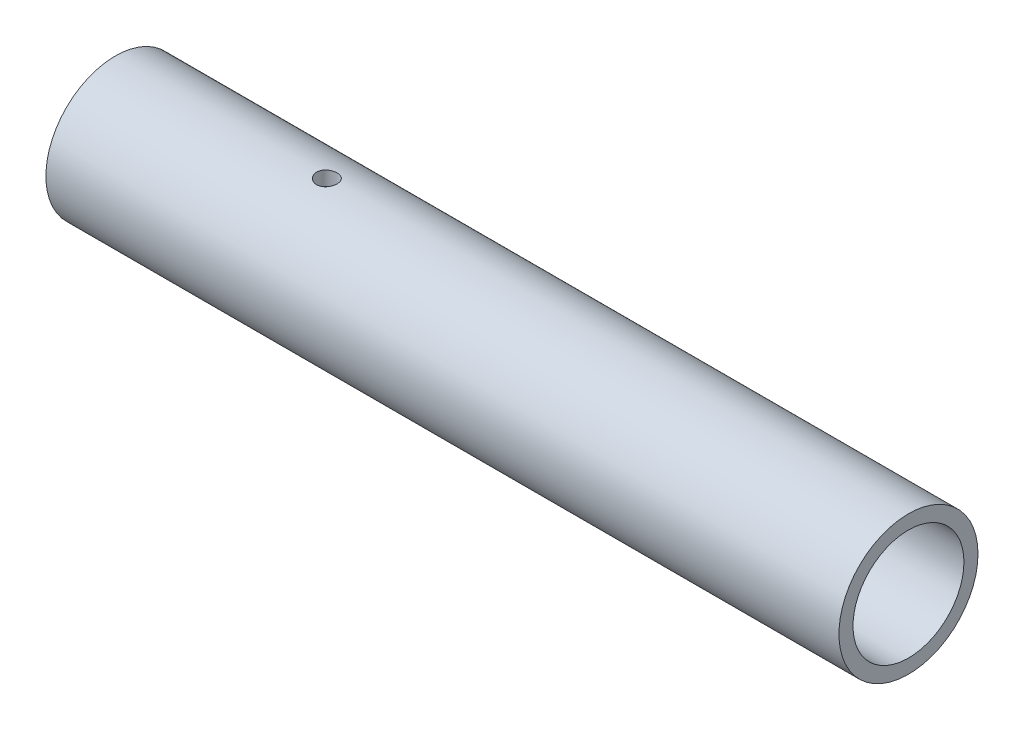
ISO-10303-21;
HEADER;
FILE_DESCRIPTION(('STEP AP214'),'2;1');
FILE_NAME('part.step','',(''),(''),'','','');
FILE_SCHEMA(('AUTOMOTIVE_DESIGN { 1 0 10303 214 1 1 1 1 }'));
ENDSEC;
DATA;
#1=APPLICATION_CONTEXT('core data for automotive mechanical design processes');
#2=APPLICATION_PROTOCOL_DEFINITION('international standard','automotive_design',2000,#1);
#3=PRODUCT_CONTEXT('',#1,'mechanical');
#4=PRODUCT('Part','Part','',(#3));
#5=PRODUCT_RELATED_PRODUCT_CATEGORY('part','',(#4));
#6=PRODUCT_DEFINITION_FORMATION('','',#4);
#7=PRODUCT_DEFINITION_CONTEXT('part definition',#1,'design');
#8=PRODUCT_DEFINITION('design','',#6,#7);
#9=PRODUCT_DEFINITION_SHAPE('','',#8);
#10=(LENGTH_UNIT() NAMED_UNIT(*) SI_UNIT(.MILLI.,.METRE.));
#11=(NAMED_UNIT(*) PLANE_ANGLE_UNIT() SI_UNIT($,.RADIAN.));
#12=(NAMED_UNIT(*) SI_UNIT($,.STERADIAN.) SOLID_ANGLE_UNIT());
#13=UNCERTAINTY_MEASURE_WITH_UNIT(LENGTH_MEASURE(1.E-05),#10,'distance_accuracy_value','');
#14=(GEOMETRIC_REPRESENTATION_CONTEXT(3) GLOBAL_UNCERTAINTY_ASSIGNED_CONTEXT((#13)) GLOBAL_UNIT_ASSIGNED_CONTEXT((#10,
#11,#12)) REPRESENTATION_CONTEXT('',''));
#15=CARTESIAN_POINT('',(0.,0.,0.));
#16=DIRECTION('',(0.,0.,1.));
#17=DIRECTION('',(1.,0.,0.));
#18=AXIS2_PLACEMENT_3D('',#15,#16,#17);
#19=CARTESIAN_POINT('',(190.5,0.,0.));
#20=DIRECTION('',(1.,0.,0.));
#21=DIRECTION('',(0.,0.,-1.));
#22=AXIS2_PLACEMENT_3D('',#19,#20,#21);
#23=CYLINDRICAL_SURFACE('',#22,13.3223);
#24=CARTESIAN_POINT('',(50.678688103976,-13.094248102263,2.45445389575423));
#25=CARTESIAN_POINT('',(50.5418224268765,-13.0955186791606,2.44768393004281));
#26=CARTESIAN_POINT('',(50.4054735602038,-13.0989480892506,2.42943529101028));
#27=CARTESIAN_POINT('',(50.1377900875984,-13.1097367075667,2.37051786913981));
#28=CARTESIAN_POINT('',(50.0064600943428,-13.1170994419253,2.3298289680745));
#29=CARTESIAN_POINT('',(49.7527002223779,-13.1348939660872,2.22731391930037));
#30=CARTESIAN_POINT('',(49.6302618822235,-13.1453227891315,2.16550819498143));
#31=CARTESIAN_POINT('',(49.3974877480992,-13.1680756823768,2.02254266967228));
#32=CARTESIAN_POINT('',(49.2871508179416,-13.1803995743907,1.94138468791859));
#33=CARTESIAN_POINT('',(49.0803540659709,-13.2057234855463,1.7609415493719));
#34=CARTESIAN_POINT('',(48.9840609880477,-13.2187294693681,1.66146606754111));
#35=CARTESIAN_POINT('',(48.8094599824654,-13.2438431523428,1.44770736090251));
#36=CARTESIAN_POINT('',(48.7311529004727,-13.2559508092402,1.33342344022594));
#37=CARTESIAN_POINT('',(48.5944410088035,-13.2779711460215,1.09262168331388));
#38=CARTESIAN_POINT('',(48.5361272988663,-13.2878737084947,0.966051133832915));
#39=CARTESIAN_POINT('',(48.4416576019729,-13.3042931753712,0.704688100131653));
#40=CARTESIAN_POINT('',(48.4054995737108,-13.3108103916738,0.56989637462509));
#41=CARTESIAN_POINT('',(48.3567982295369,-13.3196576802456,0.29779177703789));
#42=CARTESIAN_POINT('',(48.3439536729047,-13.3220411477954,0.160534555414371));
#43=CARTESIAN_POINT('',(48.3413647442424,-13.3225185635427,-0.114199369083448));
#44=CARTESIAN_POINT('',(48.3516188051289,-13.320612802735,-0.251676056436179));
#45=CARTESIAN_POINT('',(48.3946756892952,-13.3127670814004,-0.521490643613132));
#46=CARTESIAN_POINT('',(48.427248944641,-13.3068682001921,-0.653866501925073));
#47=CARTESIAN_POINT('',(48.5137134509261,-13.2917238406163,-0.911256691554821));
#48=CARTESIAN_POINT('',(48.5676058037636,-13.2824781892698,-1.03627064198151));
#49=CARTESIAN_POINT('',(48.6956665535277,-13.2615545448244,-1.27652779096327));
#50=CARTESIAN_POINT('',(48.7699960562217,-13.2498574086408,-1.39168339755758));
#51=CARTESIAN_POINT('',(48.9366598936949,-13.2253497680949,-1.60800227237215));
#52=CARTESIAN_POINT('',(49.0289959640717,-13.2125391564742,-1.70916419017584));
#53=CARTESIAN_POINT('',(49.2306129689055,-13.1870191403829,-1.8961143305859));
#54=CARTESIAN_POINT('',(49.3401157068134,-13.174313749858,-1.98166409678478));
#55=CARTESIAN_POINT('',(49.5720908857393,-13.1506307052616,-2.13318810091539));
#56=CARTESIAN_POINT('',(49.6945631991372,-13.139653034192,-2.19916253144325));
#57=CARTESIAN_POINT('',(49.9488893185222,-13.1207076850191,-2.30951399379018));
#58=CARTESIAN_POINT('',(50.0807288793875,-13.1127355479872,-2.35392304783908));
#59=CARTESIAN_POINT('',(50.350172171525,-13.1007201484129,-2.41990661589373));
#60=CARTESIAN_POINT('',(50.4877752507127,-13.0966764426535,-2.44148370589225));
#61=CARTESIAN_POINT('',(50.7625818573484,-13.0930297957402,-2.46096428621847));
#62=CARTESIAN_POINT('',(50.8997592476047,-13.0933598135124,-2.45922516601841));
#63=CARTESIAN_POINT('',(51.1718391271721,-13.0982585448134,-2.4329969244998));
#64=CARTESIAN_POINT('',(51.3067416795329,-13.102827140668,-2.40850843476357));
#65=CARTESIAN_POINT('',(51.5697654684394,-13.1156384395196,-2.33772922921319));
#66=CARTESIAN_POINT('',(51.6979177436446,-13.1238623113673,-2.29155018981434));
#67=CARTESIAN_POINT('',(51.9446891673687,-13.1430505289193,-2.17879644302101));
#68=CARTESIAN_POINT('',(52.0633075237173,-13.1540151020374,-2.11222004302295));
#69=CARTESIAN_POINT('',(52.2893346048534,-13.1776294191417,-1.95953712919561));
#70=CARTESIAN_POINT('',(52.3965759882631,-13.1902993708159,-1.87318602326433));
#71=CARTESIAN_POINT('',(52.5951636222278,-13.2158053161587,-1.68382739040145));
#72=CARTESIAN_POINT('',(52.6865086760892,-13.2286413222502,-1.58081861058662));
#73=CARTESIAN_POINT('',(52.8517093196239,-13.2532020222888,-1.35970569904992));
#74=CARTESIAN_POINT('',(52.9253626646217,-13.2649130238339,-1.24144876751071));
#75=CARTESIAN_POINT('',(53.0517285376712,-13.2857441158786,-0.994018659490911));
#76=CARTESIAN_POINT('',(53.1044422813319,-13.2948643567712,-0.864846117223643));
#77=CARTESIAN_POINT('',(53.1869936635411,-13.3094217348682,-0.600306437321865));
#78=CARTESIAN_POINT('',(53.2170085981084,-13.3148873776677,-0.464996248088086));
#79=CARTESIAN_POINT('',(53.253894999143,-13.3216320835144,-0.191159340950818));
#80=CARTESIAN_POINT('',(53.2607686653509,-13.3229115444872,-0.0526329300323859));
#81=CARTESIAN_POINT('',(53.251225793513,-13.3211526457135,0.221618653861163));
#82=CARTESIAN_POINT('',(53.235136848047,-13.3181750180303,0.357355756627565));
#83=CARTESIAN_POINT('',(53.1807610756263,-13.3083407127711,0.624157971647961));
#84=CARTESIAN_POINT('',(53.1424740371454,-13.3014839982312,0.755223039369389));
#85=CARTESIAN_POINT('',(53.0447933023809,-13.2846305886335,1.00920899497348));
#86=CARTESIAN_POINT('',(52.9853718648826,-13.2746297686051,1.1321189255363));
#87=CARTESIAN_POINT('',(52.8471396478953,-13.2525755283095,1.36629823432816));
#88=CARTESIAN_POINT('',(52.7683274982695,-13.2405219630151,1.47756678919207));
#89=CARTESIAN_POINT('',(52.5921838208907,-13.2154775732462,1.68705018368414));
#90=CARTESIAN_POINT('',(52.4945975860328,-13.2024755936137,1.7850495904989));
#91=CARTESIAN_POINT('',(52.2843183722291,-13.1771372509761,1.96338146001379));
#92=CARTESIAN_POINT('',(52.1716221148754,-13.1648010332379,2.04371007868298));
#93=CARTESIAN_POINT('',(51.9334644867777,-13.1421167957647,2.184857517692));
#94=CARTESIAN_POINT('',(51.8079278002515,-13.1317816720822,2.24555137951656));
#95=CARTESIAN_POINT('',(51.5482817437936,-13.1144130806487,2.34487018117609));
#96=CARTESIAN_POINT('',(51.4141808611188,-13.1073764000531,2.38351660429228));
#97=CARTESIAN_POINT('',(51.1793482837451,-13.0988091650531,2.43007092758558));
#98=CARTESIAN_POINT('',(51.0797187619862,-13.0962911533853,2.44354073659947));
#99=CARTESIAN_POINT('',(50.8795296963959,-13.0935451696192,2.45821227178194));
#100=CARTESIAN_POINT('',(50.7789701739029,-13.0933171451085,2.45941427873163));
#101=CARTESIAN_POINT('',(50.678688103976,-13.094248102263,2.45445389575423));
#102=B_SPLINE_CURVE_WITH_KNOTS('',3,(#24,#25,#26,#27,#28,#29,#30,#31,#32,#33,#34,#35,#36,#37,
#38,#39,#40,#41,#42,#43,#44,#45,#46,#47,#48,#49,#50,#51,#52,#53,#54,#55,#56,#57,#58,#59,#60,#61,
#62,#63,#64,#65,#66,#67,#68,#69,#70,#71,#72,#73,#74,#75,#76,#77,#78,#79,#80,#81,#82,#83,#84,#85,
#86,#87,#88,#89,#90,#91,#92,#93,#94,#95,#96,#97,#98,#99,#100,#101),.UNSPECIFIED.,.T.,.F.,(4,2,2,
2,2,2,2,2,2,2,2,2,2,2,2,2,2,2,2,2,2,2,2,2,2,2,2,2,2,2,2,2,2,2,2,2,2,2,4),(0.,0.410748221038754,
0.821865287632036,1.23258585769935,1.64326783260586,2.05848606689297,2.47372381993288,
2.89082921181887,3.30789616806747,3.71953462896374,4.13114516384408,4.53858433438121,
4.94604456655958,5.35681374650054,5.76762253880644,6.18425922407544,6.60089181003935,
7.01690383586135,7.43286892054998,7.84246550302569,8.25205071436289,8.65954986216415,
9.06708283401897,9.47995844707798,9.89286512844405,10.3102885307486,10.7276876967821,
11.1417919722248,11.555856883027,11.9640733089576,12.3722936248564,12.7810517642583,
13.1898387945765,13.6046224507508,14.0194962482321,14.4369606697882,14.8540176112865,
15.1549814868096,15.4559384739629),.UNSPECIFIED.);
#103=CARTESIAN_POINT('',(50.678688103976,-13.094248102263,2.45445389575423));
#104=VERTEX_POINT('',#103);
#105=EDGE_CURVE('E57',#104,#104,#102,.T.);
#106=ORIENTED_EDGE('',*,*,#105,.T.);
#107=EDGE_LOOP('',(#106));
#108=FACE_BOUND('',#107,.T.);
#109=CARTESIAN_POINT('',(0.,0.,0.));
#110=DIRECTION('',(1.,0.,0.));
#111=DIRECTION('',(0.,0.,-1.));
#112=AXIS2_PLACEMENT_3D('',#109,#110,#111);
#113=CIRCLE('',#112,13.3223);
#114=CARTESIAN_POINT('',(0.,0.,-13.3223));
#115=VERTEX_POINT('',#114);
#116=EDGE_CURVE('E68',#115,#115,#113,.F.);
#117=ORIENTED_EDGE('',*,*,#116,.T.);
#118=EDGE_LOOP('',(#117));
#119=FACE_BOUND('',#118,.T.);
#120=CARTESIAN_POINT('',(190.5,0.,0.));
#121=DIRECTION('',(1.,0.,0.));
#122=DIRECTION('',(0.,0.,-1.));
#123=AXIS2_PLACEMENT_3D('',#120,#121,#122);
#124=CIRCLE('',#123,13.3223);
#125=CARTESIAN_POINT('',(190.5,0.,-13.3223));
#126=VERTEX_POINT('',#125);
#127=EDGE_CURVE('E16',#126,#126,#124,.F.);
#128=ORIENTED_EDGE('',*,*,#127,.F.);
#129=EDGE_LOOP('',(#128));
#130=FACE_BOUND('',#129,.T.);
#131=CARTESIAN_POINT('',(50.9213118960241,13.094248102263,2.45445389575422));
#132=CARTESIAN_POINT('',(51.0581775731236,13.0955186791606,2.44768393004281));
#133=CARTESIAN_POINT('',(51.1945264397963,13.0989480892506,2.42943529101027));
#134=CARTESIAN_POINT('',(51.4622099124017,13.1097367075667,2.37051786913979));
#135=CARTESIAN_POINT('',(51.5935399056572,13.1170994419253,2.32982896807447));
#136=CARTESIAN_POINT('',(51.8472997776222,13.1348939660872,2.22731391930034));
#137=CARTESIAN_POINT('',(51.9697381177766,13.1453227891315,2.16550819498139));
#138=CARTESIAN_POINT('',(52.2025122519009,13.1680756823769,2.02254266967224));
#139=CARTESIAN_POINT('',(52.3128491820584,13.1803995743907,1.94138468791854));
#140=CARTESIAN_POINT('',(52.5196459340291,13.2057234855463,1.76094154937185));
#141=CARTESIAN_POINT('',(52.6159390119524,13.2187294693681,1.66146606754105));
#142=CARTESIAN_POINT('',(52.7905400175346,13.2438431523429,1.44770736090245));
#143=CARTESIAN_POINT('',(52.8688470995274,13.2559508092402,1.33342344022588));
#144=CARTESIAN_POINT('',(53.0055589911966,13.2779711460215,1.09262168331382));
#145=CARTESIAN_POINT('',(53.0638727011337,13.2878737084947,0.96605113383285));
#146=CARTESIAN_POINT('',(53.1583423980271,13.3042931753713,0.704688100131584));
#147=CARTESIAN_POINT('',(53.1945004262892,13.3108103916738,0.569896374625021));
#148=CARTESIAN_POINT('',(53.2432017704631,13.3196576802456,0.29779177703782));
#149=CARTESIAN_POINT('',(53.2560463270953,13.3220411477954,0.160534555414301));
#150=CARTESIAN_POINT('',(53.2586352557576,13.3225185635427,-0.114199369083519));
#151=CARTESIAN_POINT('',(53.2483811948711,13.320612802735,-0.251676056436249));
#152=CARTESIAN_POINT('',(53.2053243107048,13.3127670814004,-0.5214906436132));
#153=CARTESIAN_POINT('',(53.172751055359,13.3068682001921,-0.65386650192514));
#154=CARTESIAN_POINT('',(53.0862865490739,13.2917238406163,-0.911256691554886));
#155=CARTESIAN_POINT('',(53.0323941962364,13.2824781892698,-1.03627064198157));
#156=CARTESIAN_POINT('',(52.9043334464723,13.2615545448244,-1.27652779096333));
#157=CARTESIAN_POINT('',(52.8300039437782,13.2498574086408,-1.39168339755764));
#158=CARTESIAN_POINT('',(52.663340106305,13.2253497680949,-1.6080022723722));
#159=CARTESIAN_POINT('',(52.5710040359283,13.2125391564742,-1.70916419017589));
#160=CARTESIAN_POINT('',(52.3693870310945,13.1870191403829,-1.89611433058595));
#161=CARTESIAN_POINT('',(52.2598842931865,13.174313749858,-1.98166409678482));
#162=CARTESIAN_POINT('',(52.0279091142607,13.1506307052616,-2.13318810091542));
#163=CARTESIAN_POINT('',(51.9054368008628,13.139653034192,-2.19916253144328));
#164=CARTESIAN_POINT('',(51.6511106814777,13.1207076850191,-2.30951399379021));
#165=CARTESIAN_POINT('',(51.5192711206125,13.1127355479872,-2.3539230478391));
#166=CARTESIAN_POINT('',(51.249827828475,13.1007201484129,-2.41990661589374));
#167=CARTESIAN_POINT('',(51.1122247492873,13.0966764426535,-2.44148370589226));
#168=CARTESIAN_POINT('',(50.8374181426515,13.0930297957402,-2.46096428621847));
#169=CARTESIAN_POINT('',(50.7002407523952,13.0933598135124,-2.45922516601841));
#170=CARTESIAN_POINT('',(50.4281608728278,13.0982585448134,-2.43299692449979));
#171=CARTESIAN_POINT('',(50.293258320467,13.102827140668,-2.40850843476355));
#172=CARTESIAN_POINT('',(50.0302345315606,13.1156384395196,-2.33772922921317));
#173=CARTESIAN_POINT('',(49.9020822563554,13.1238623113673,-2.29155018981432));
#174=CARTESIAN_POINT('',(49.6553108326312,13.1430505289194,-2.17879644302098));
#175=CARTESIAN_POINT('',(49.5366924762827,13.1540151020374,-2.11222004302292));
#176=CARTESIAN_POINT('',(49.3106653951466,13.1776294191417,-1.95953712919557));
#177=CARTESIAN_POINT('',(49.2034240117368,13.1902993708159,-1.87318602326429));
#178=CARTESIAN_POINT('',(49.0048363777722,13.2158053161587,-1.68382739040139));
#179=CARTESIAN_POINT('',(48.9134913239108,13.2286413222502,-1.58081861058656));
#180=CARTESIAN_POINT('',(48.7482906803761,13.2532020222888,-1.35970569904986));
#181=CARTESIAN_POINT('',(48.6746373353783,13.2649130238339,-1.24144876751065));
#182=CARTESIAN_POINT('',(48.5482714623288,13.2857441158786,-0.994018659490848));
#183=CARTESIAN_POINT('',(48.495557718668,13.2948643567712,-0.864846117223577));
#184=CARTESIAN_POINT('',(48.4130063364588,13.3094217348682,-0.600306437321794));
#185=CARTESIAN_POINT('',(48.3829914018916,13.3148873776677,-0.464996248088015));
#186=CARTESIAN_POINT('',(48.346105000857,13.3216320835144,-0.191159340950747));
#187=CARTESIAN_POINT('',(48.3392313346491,13.3229115444872,-0.0526329300323145));
#188=CARTESIAN_POINT('',(48.348774206487,13.3211526457135,0.221618653861235));
#189=CARTESIAN_POINT('',(48.364863151953,13.3181750180303,0.357355756627636));
#190=CARTESIAN_POINT('',(48.4192389243737,13.3083407127711,0.624157971648031));
#191=CARTESIAN_POINT('',(48.4575259628546,13.3014839982312,0.755223039369457));
#192=CARTESIAN_POINT('',(48.5552066976191,13.2846305886335,1.00920899497355));
#193=CARTESIAN_POINT('',(48.6146281351174,13.2746297686051,1.13211892553636));
#194=CARTESIAN_POINT('',(48.7528603521048,13.2525755283095,1.36629823432822));
#195=CARTESIAN_POINT('',(48.8316725017305,13.2405219630151,1.47756678919213));
#196=CARTESIAN_POINT('',(49.0078161791093,13.2154775732462,1.68705018368419));
#197=CARTESIAN_POINT('',(49.1054024139672,13.2024755936137,1.78504959049895));
#198=CARTESIAN_POINT('',(49.315681627771,13.1771372509761,1.96338146001383));
#199=CARTESIAN_POINT('',(49.4283778851247,13.1648010332378,2.04371007868302));
#200=CARTESIAN_POINT('',(49.6665355132224,13.1421167957647,2.18485751769203));
#201=CARTESIAN_POINT('',(49.7920721997485,13.1317816720821,2.24555137951659));
#202=CARTESIAN_POINT('',(50.0517182562064,13.1144130806487,2.34487018117611));
#203=CARTESIAN_POINT('',(50.1858191388813,13.1073764000531,2.3835166042923));
#204=CARTESIAN_POINT('',(50.4206517162549,13.0988091650531,2.43007092758559));
#205=CARTESIAN_POINT('',(50.5202812380139,13.0962911533853,2.44354073659948));
#206=CARTESIAN_POINT('',(50.7204703036042,13.0935451696192,2.45821227178195));
#207=CARTESIAN_POINT('',(50.8210298260972,13.0933171451085,2.45941427873163));
#208=CARTESIAN_POINT('',(50.9213118960241,13.094248102263,2.45445389575422));
#209=B_SPLINE_CURVE_WITH_KNOTS('',3,(#131,#132,#133,#134,#135,#136,#137,#138,#139,#140,#141,
#142,#143,#144,#145,#146,#147,#148,#149,#150,#151,#152,#153,#154,#155,#156,#157,#158,#159,#160,
#161,#162,#163,#164,#165,#166,#167,#168,#169,#170,#171,#172,#173,#174,#175,#176,#177,#178,#179,
#180,#181,#182,#183,#184,#185,#186,#187,#188,#189,#190,#191,#192,#193,#194,#195,#196,#197,#198,
#199,#200,#201,#202,#203,#204,#205,#206,#207,#208),.UNSPECIFIED.,.T.,.F.,(4,2,2,2,2,2,2,2,2,2,2,
2,2,2,2,2,2,2,2,2,2,2,2,2,2,2,2,2,2,2,2,2,2,2,2,2,2,2,4),(0.,0.410748221038756,
0.821865287632034,1.23258585769935,1.64326783260586,2.05848606689297,2.47372381993288,
2.89082921181887,3.30789616806747,3.71953462896374,4.13114516384408,4.53858433438121,
4.94604456655958,5.35681374650054,5.76762253880644,6.18425922407543,6.60089181003934,
7.01690383586135,7.43286892054997,7.84246550302567,8.25205071436288,8.65954986216414,
9.06708283401897,9.47995844707798,9.89286512844405,10.3102885307486,10.7276876967821,
11.1417919722248,11.555856883027,11.9640733089576,12.3722936248564,12.7810517642583,
13.1898387945765,13.6046224507508,14.0194962482321,14.4369606697882,14.8540176112865,
15.1549814868096,15.4559384739629),.UNSPECIFIED.);
#210=CARTESIAN_POINT('',(50.9213118960241,13.094248102263,2.45445389575422));
#211=VERTEX_POINT('',#210);
#212=EDGE_CURVE('E60',#211,#211,#209,.T.);
#213=ORIENTED_EDGE('',*,*,#212,.T.);
#214=EDGE_LOOP('',(#213));
#215=FACE_BOUND('',#214,.T.);
#216=ADVANCED_FACE('F12',(#108,#119,#130,#215),#23,.F.);
#217=CARTESIAN_POINT('',(190.5,0.,0.));
#218=DIRECTION('',(1.,0.,0.));
#219=DIRECTION('',(0.,0.,-1.));
#220=AXIS2_PLACEMENT_3D('',#217,#218,#219);
#221=PLANE('',#220);
#222=CARTESIAN_POINT('',(190.5,0.,0.));
#223=DIRECTION('',(1.,0.,0.));
#224=DIRECTION('',(0.,0.,-1.));
#225=AXIS2_PLACEMENT_3D('',#222,#223,#224);
#226=CIRCLE('',#225,16.7005);
#227=CARTESIAN_POINT('',(190.5,0.,-16.7005));
#228=VERTEX_POINT('',#227);
#229=EDGE_CURVE('E55',#228,#228,#226,.F.);
#230=ORIENTED_EDGE('',*,*,#229,.F.);
#231=EDGE_LOOP('',(#230));
#232=FACE_BOUND('',#231,.T.);
#233=ORIENTED_EDGE('',*,*,#127,.T.);
#234=EDGE_LOOP('',(#233));
#235=FACE_BOUND('',#234,.T.);
#236=ADVANCED_FACE('F76',(#232,#235),#221,.T.);
#237=CARTESIAN_POINT('',(0.,0.,0.));
#238=DIRECTION('',(1.,0.,0.));
#239=DIRECTION('',(0.,0.,-1.));
#240=AXIS2_PLACEMENT_3D('',#237,#238,#239);
#241=PLANE('',#240);
#242=CARTESIAN_POINT('',(0.,0.,0.));
#243=DIRECTION('',(1.,0.,0.));
#244=DIRECTION('',(0.,0.,-1.));
#245=AXIS2_PLACEMENT_3D('',#242,#243,#244);
#246=CIRCLE('',#245,16.7005);
#247=CARTESIAN_POINT('',(0.,0.,-16.7005));
#248=VERTEX_POINT('',#247);
#249=EDGE_CURVE('E25',#248,#248,#246,.T.);
#250=ORIENTED_EDGE('',*,*,#249,.F.);
#251=EDGE_LOOP('',(#250));
#252=FACE_BOUND('',#251,.T.);
#253=ORIENTED_EDGE('',*,*,#116,.F.);
#254=EDGE_LOOP('',(#253));
#255=FACE_BOUND('',#254,.T.);
#256=ADVANCED_FACE('F72',(#252,#255),#241,.F.);
#257=CARTESIAN_POINT('',(50.8,-196.27895730604,0.));
#258=DIRECTION('',(0.,-1.,0.));
#259=DIRECTION('',(0.,0.,-1.));
#260=AXIS2_PLACEMENT_3D('',#257,#258,#259);
#261=CYLINDRICAL_SURFACE('',#260,2.45745);
#262=CARTESIAN_POINT('',(50.6784887531976,16.5191526638202,2.45444403468494));
#263=CARTESIAN_POINT('',(50.5412584268879,16.5201643145239,2.44764449846654));
#264=CARTESIAN_POINT('',(50.4045306635083,16.5228961281567,2.42930495839065));
#265=CARTESIAN_POINT('',(50.1360629114938,16.5314969362856,2.37005959271904));
#266=CARTESIAN_POINT('',(50.0043280936073,16.5373690927519,2.3291310211895));
#267=CARTESIAN_POINT('',(49.7497491491626,16.5515715040404,2.22595527933086));
#268=CARTESIAN_POINT('',(49.6268981125999,16.55989982223,2.16372489884745));
#269=CARTESIAN_POINT('',(49.3933919271252,16.5780763150978,2.01973521569634));
#270=CARTESIAN_POINT('',(49.2827349682816,16.5879242636992,1.93797881694002));
#271=CARTESIAN_POINT('',(49.0758759899209,16.6081170832378,1.75656310318754));
#272=CARTESIAN_POINT('',(48.9797812312795,16.618464964736,1.65678178923714));
#273=CARTESIAN_POINT('',(48.8056542463731,16.638435995744,1.44246642846114));
#274=CARTESIAN_POINT('',(48.7276227989718,16.648059113991,1.32793174582308));
#275=CARTESIAN_POINT('',(48.5916492989032,16.6655295582417,1.08694108278926));
#276=CARTESIAN_POINT('',(48.5337643854157,16.6733718118805,0.960452468460543));
#277=CARTESIAN_POINT('',(48.4401029457424,16.6863593390874,0.699408531924412));
#278=CARTESIAN_POINT('',(48.4043251226355,16.6915047708629,0.564853683433864));
#279=CARTESIAN_POINT('',(48.3561652215447,16.6984849380349,0.292694935470008));
#280=CARTESIAN_POINT('',(48.3435905671445,16.7003469188881,0.155125811228391));
#281=CARTESIAN_POINT('',(48.3416336908924,16.700634796982,-0.120177043775823));
#282=CARTESIAN_POINT('',(48.3522504389405,16.6990608468377,-0.25791076695579));
#283=CARTESIAN_POINT('',(48.3962057120851,16.6926752053303,-0.528705437515149));
#284=CARTESIAN_POINT('',(48.4293972008464,16.6878844684641,-0.661790799195879));
#285=CARTESIAN_POINT('',(48.5173650597772,16.6756162539249,-0.920492535411771));
#286=CARTESIAN_POINT('',(48.5721421983227,16.6681386806104,-1.04610864388362));
#287=CARTESIAN_POINT('',(48.7020532108484,16.6512722447284,-1.28705598524368));
#288=CARTESIAN_POINT('',(48.7772939007759,16.6418734193957,-1.40232890713171));
#289=CARTESIAN_POINT('',(48.9458890990048,16.622225381754,-1.61868614696767));
#290=CARTESIAN_POINT('',(49.0392447132994,16.6119761175441,-1.71976959793826));
#291=CARTESIAN_POINT('',(49.2424219621942,16.5916666740074,-1.905821036624));
#292=CARTESIAN_POINT('',(49.3523841419823,16.5816090244323,-1.99063590316435));
#293=CARTESIAN_POINT('',(49.5850929370479,16.5629167273628,-2.14061254074834));
#294=CARTESIAN_POINT('',(49.7078394424125,16.5542820676358,-2.20577448073838));
#295=CARTESIAN_POINT('',(49.9625229242925,16.5394342591104,-2.3144844328939));
#296=CARTESIAN_POINT('',(50.094448518917,16.5332181722544,-2.35805868726637));
#297=CARTESIAN_POINT('',(50.3638532100648,16.5239147035733,-2.42239809722276));
#298=CARTESIAN_POINT('',(50.5013319191193,16.5208271038485,-2.44316484136148));
#299=CARTESIAN_POINT('',(50.7765093887802,16.5181550749016,-2.46116565081579));
#300=CARTESIAN_POINT('',(50.9141930255175,16.5185368910976,-2.45862646137163));
#301=CARTESIAN_POINT('',(51.1871560046612,16.5226784298022,-2.43063638285711));
#302=CARTESIAN_POINT('',(51.3224353886142,16.526438093882,-2.40518589009859));
#303=CARTESIAN_POINT('',(51.5863545800905,16.53688736062,-2.33225128458954));
#304=CARTESIAN_POINT('',(51.7150130274987,16.5435681706881,-2.28483326833561));
#305=CARTESIAN_POINT('',(51.9625700756913,16.5591040863889,-2.16936592564014));
#306=CARTESIAN_POINT('',(52.0814681401293,16.5679593114021,-2.10131546638105));
#307=CARTESIAN_POINT('',(52.3072167540786,16.5869395905917,-1.94584154642244));
#308=CARTESIAN_POINT('',(52.4139574709729,16.5970747059823,-1.85825983746056));
#309=CARTESIAN_POINT('',(52.6112987339594,16.6174242224533,-1.66649007433657));
#310=CARTESIAN_POINT('',(52.7018985331932,16.6276386271798,-1.56230125216704));
#311=CARTESIAN_POINT('',(52.8649925765685,16.6470782536842,-1.33942543431498));
#312=CARTESIAN_POINT('',(52.9373609617538,16.6562963611569,-1.22064564929124));
#313=CARTESIAN_POINT('',(53.0611001051505,16.6726252948748,-0.972475928070609));
#314=CARTESIAN_POINT('',(53.1124716786507,16.6797362029378,-0.84308640407543));
#315=CARTESIAN_POINT('',(53.1924748982204,16.6910156818831,-0.578082222754595));
#316=CARTESIAN_POINT('',(53.2212255606745,16.6951996393723,-0.44250417189865));
#317=CARTESIAN_POINT('',(53.2555616190047,16.7002134017517,-0.168387647004295));
#318=CARTESIAN_POINT('',(53.2611483863472,16.7010434052197,-0.0298493487216766));
#319=CARTESIAN_POINT('',(53.2490431649986,16.6992640781553,0.2449363826067));
#320=CARTESIAN_POINT('',(53.2315588804406,16.6966854346302,0.381193223197926));
#321=CARTESIAN_POINT('',(53.1742018047147,16.6884294334425,0.648809809339512));
#322=CARTESIAN_POINT('',(53.134328804702,16.6827520468744,0.780169509196533));
#323=CARTESIAN_POINT('',(53.0333077598797,16.6689175186466,1.03447598109151));
#324=CARTESIAN_POINT('',(52.9721337647027,16.6607573538295,1.15741227150595));
#325=CARTESIAN_POINT('',(52.8302686418743,16.6428572395781,1.39132389046495));
#326=CARTESIAN_POINT('',(52.7495768642383,16.6331172375352,1.50229882049214));
#327=CARTESIAN_POINT('',(52.5700653290056,16.6130298581877,1.71025555590797));
#328=CARTESIAN_POINT('',(52.4710819521915,16.602677623345,1.80709568504243));
#329=CARTESIAN_POINT('',(52.2582151735265,16.582606155809,1.98285702031692));
#330=CARTESIAN_POINT('',(52.1443284511958,16.5728870649058,2.06177422246103));
#331=CARTESIAN_POINT('',(51.9043938842092,16.5551493991107,2.1996810722912));
#332=CARTESIAN_POINT('',(51.7783031374444,16.5471371654741,2.25859687644003));
#333=CARTESIAN_POINT('',(51.5179553584942,16.5337916568955,2.35431426399146));
#334=CARTESIAN_POINT('',(51.3837071124983,16.5284555549684,2.39113919163653));
#335=CARTESIAN_POINT('',(51.1537090296906,16.5222256460018,2.43372982042614));
#336=CARTESIAN_POINT('',(51.0590697424949,16.5204639706355,2.44561083034615));
#337=CARTESIAN_POINT('',(50.8690360084204,16.5185767599827,2.45832520372109));
#338=CARTESIAN_POINT('',(50.773641570619,16.518451205059,2.45915869977201));
#339=CARTESIAN_POINT('',(50.6784887531976,16.5191526638202,2.45444403468494));
#340=B_SPLINE_CURVE_WITH_KNOTS('',3,(#262,#263,#264,#265,#266,#267,#268,#269,#270,#271,#272,
#273,#274,#275,#276,#277,#278,#279,#280,#281,#282,#283,#284,#285,#286,#287,#288,#289,#290,#291,
#292,#293,#294,#295,#296,#297,#298,#299,#300,#301,#302,#303,#304,#305,#306,#307,#308,#309,#310,
#311,#312,#313,#314,#315,#316,#317,#318,#319,#320,#321,#322,#323,#324,#325,#326,#327,#328,#329,
#330,#331,#332,#333,#334,#335,#336,#337,#338,#339),.UNSPECIFIED.,.T.,.F.,(4,2,2,2,2,2,2,2,2,2,2,
2,2,2,2,2,2,2,2,2,2,2,2,2,2,2,2,2,2,2,2,2,2,2,2,2,2,2,4),(0.,0.411858376636099,
0.824132231043293,1.23608188122823,1.64797030432829,2.06275877603712,2.47756512949053,
2.89353854037331,3.30948754569857,3.7219685497863,4.1344312329465,4.54423282465623,
4.95404900523177,5.36604682631284,5.77806980953357,6.19379857001769,6.60952375658744,
7.02474233581166,7.43993199301417,7.85108655226542,8.26223399964292,8.67215233032942,
9.08209317152488,9.49548463781674,9.90889522723227,10.3250860384975,10.7412606878802,
11.1552307779529,11.5691763577158,11.9794205752046,12.3896686195671,12.8004182157134,
13.2111814926013,13.625814504439,14.0405400546987,14.4567804978259,14.8725803059535,
15.1581582561111,15.4437327786627),.UNSPECIFIED.);
#341=CARTESIAN_POINT('',(50.6784887531976,16.5191526638202,2.45444403468494));
#342=VERTEX_POINT('',#341);
#343=EDGE_CURVE('E20',#342,#342,#340,.T.);
#344=ORIENTED_EDGE('',*,*,#343,.F.);
#345=EDGE_LOOP('',(#344));
#346=FACE_BOUND('',#345,.T.);
#347=ORIENTED_EDGE('',*,*,#212,.F.);
#348=EDGE_LOOP('',(#347));
#349=FACE_BOUND('',#348,.T.);
#350=ADVANCED_FACE('F45',(#346,#349),#261,.F.);
#351=CARTESIAN_POINT('',(50.8,-196.27895730604,0.));
#352=DIRECTION('',(0.,-1.,0.));
#353=DIRECTION('',(0.,0.,-1.));
#354=AXIS2_PLACEMENT_3D('',#351,#352,#353);
#355=CYLINDRICAL_SURFACE('',#354,2.45745);
#356=CARTESIAN_POINT('',(50.9215112468024,-16.5191526638202,2.45444403468494));
#357=CARTESIAN_POINT('',(51.0587415731121,-16.5201643145239,2.44764449846654));
#358=CARTESIAN_POINT('',(51.1954693364917,-16.5228961281567,2.42930495839065));
#359=CARTESIAN_POINT('',(51.4639370885062,-16.5314969362856,2.37005959271904));
#360=CARTESIAN_POINT('',(51.5956719063927,-16.5373690927519,2.3291310211895));
#361=CARTESIAN_POINT('',(51.8502508508374,-16.5515715040404,2.22595527933086));
#362=CARTESIAN_POINT('',(51.9731018874001,-16.55989982223,2.16372489884745));
#363=CARTESIAN_POINT('',(52.2066080728748,-16.5780763150978,2.01973521569634));
#364=CARTESIAN_POINT('',(52.3172650317184,-16.5879242636992,1.93797881694002));
#365=CARTESIAN_POINT('',(52.5241240100791,-16.6081170832378,1.75656310318754));
#366=CARTESIAN_POINT('',(52.6202187687205,-16.618464964736,1.65678178923713));
#367=CARTESIAN_POINT('',(52.7943457536269,-16.638435995744,1.44246642846114));
#368=CARTESIAN_POINT('',(52.8723772010282,-16.648059113991,1.32793174582308));
#369=CARTESIAN_POINT('',(53.0083507010968,-16.6655295582417,1.08694108278926));
#370=CARTESIAN_POINT('',(53.0662356145843,-16.6733718118805,0.960452468460543));
#371=CARTESIAN_POINT('',(53.1598970542576,-16.6863593390874,0.699408531924412));
#372=CARTESIAN_POINT('',(53.1956748773645,-16.6915047708629,0.564853683433864));
#373=CARTESIAN_POINT('',(53.2438347784553,-16.6984849380349,0.292694935470008));
#374=CARTESIAN_POINT('',(53.2564094328555,-16.7003469188881,0.155125811228391));
#375=CARTESIAN_POINT('',(53.2583663091076,-16.700634796982,-0.120177043775823));
#376=CARTESIAN_POINT('',(53.2477495610595,-16.6990608468377,-0.25791076695579));
#377=CARTESIAN_POINT('',(53.2037942879149,-16.6926752053303,-0.528705437515151));
#378=CARTESIAN_POINT('',(53.1706027991536,-16.6878844684641,-0.661790799195882));
#379=CARTESIAN_POINT('',(53.0826349402228,-16.6756162539249,-0.920492535411774));
#380=CARTESIAN_POINT('',(53.0278578016773,-16.6681386806104,-1.04610864388362));
#381=CARTESIAN_POINT('',(52.8979467891516,-16.6512722447284,-1.28705598524368));
#382=CARTESIAN_POINT('',(52.8227060992241,-16.6418734193957,-1.40232890713171));
#383=CARTESIAN_POINT('',(52.6541109009952,-16.622225381754,-1.61868614696767));
#384=CARTESIAN_POINT('',(52.5607552867006,-16.6119761175441,-1.71976959793826));
#385=CARTESIAN_POINT('',(52.3575780378058,-16.5916666740074,-1.905821036624));
#386=CARTESIAN_POINT('',(52.2476158580177,-16.5816090244323,-1.99063590316435));
#387=CARTESIAN_POINT('',(52.0149070629521,-16.5629167273628,-2.14061254074834));
#388=CARTESIAN_POINT('',(51.8921605575875,-16.5542820676358,-2.20577448073838));
#389=CARTESIAN_POINT('',(51.6374770757075,-16.5394342591104,-2.3144844328939));
#390=CARTESIAN_POINT('',(51.505551481083,-16.5332181722544,-2.35805868726637));
#391=CARTESIAN_POINT('',(51.2361467899352,-16.5239147035733,-2.42239809722276));
#392=CARTESIAN_POINT('',(51.0986680808807,-16.5208271038485,-2.44316484136148));
#393=CARTESIAN_POINT('',(50.8234906112198,-16.5181550749016,-2.46116565081579));
#394=CARTESIAN_POINT('',(50.6858069744825,-16.5185368910976,-2.45862646137163));
#395=CARTESIAN_POINT('',(50.4128439953388,-16.5226784298022,-2.43063638285711));
#396=CARTESIAN_POINT('',(50.2775646113858,-16.526438093882,-2.40518589009859));
#397=CARTESIAN_POINT('',(50.0136454199095,-16.53688736062,-2.33225128458954));
#398=CARTESIAN_POINT('',(49.8849869725013,-16.5435681706881,-2.28483326833561));
#399=CARTESIAN_POINT('',(49.6374299243087,-16.5591040863889,-2.16936592564014));
#400=CARTESIAN_POINT('',(49.5185318598707,-16.5679593114021,-2.10131546638105));
#401=CARTESIAN_POINT('',(49.2927832459214,-16.5869395905917,-1.94584154642244));
#402=CARTESIAN_POINT('',(49.1860425290271,-16.5970747059823,-1.85825983746056));
#403=CARTESIAN_POINT('',(48.9887012660406,-16.6174242224533,-1.66649007433657));
#404=CARTESIAN_POINT('',(48.8981014668068,-16.6276386271798,-1.56230125216704));
#405=CARTESIAN_POINT('',(48.7350074234315,-16.6470782536842,-1.33942543431498));
#406=CARTESIAN_POINT('',(48.6626390382462,-16.6562963611569,-1.22064564929124));
#407=CARTESIAN_POINT('',(48.5388998948495,-16.6726252948748,-0.972475928070609));
#408=CARTESIAN_POINT('',(48.4875283213493,-16.6797362029378,-0.84308640407543));
#409=CARTESIAN_POINT('',(48.4075251017796,-16.6910156818831,-0.578082222754595));
#410=CARTESIAN_POINT('',(48.3787744393255,-16.6951996393723,-0.44250417189865));
#411=CARTESIAN_POINT('',(48.3444383809953,-16.7002134017517,-0.168387647004295));
#412=CARTESIAN_POINT('',(48.3388516136528,-16.7010434052197,-0.0298493487216766));
#413=CARTESIAN_POINT('',(48.3509568350014,-16.6992640781553,0.2449363826067));
#414=CARTESIAN_POINT('',(48.3684411195594,-16.6966854346302,0.381193223197926));
#415=CARTESIAN_POINT('',(48.4257981952853,-16.6884294334425,0.648809809339512));
#416=CARTESIAN_POINT('',(48.465671195298,-16.6827520468744,0.780169509196533));
#417=CARTESIAN_POINT('',(48.5666922401203,-16.6689175186466,1.03447598109151));
#418=CARTESIAN_POINT('',(48.6278662352973,-16.6607573538295,1.15741227150595));
#419=CARTESIAN_POINT('',(48.7697313581257,-16.6428572395781,1.39132389046495));
#420=CARTESIAN_POINT('',(48.8504231357617,-16.6331172375352,1.50229882049214));
#421=CARTESIAN_POINT('',(49.0299346709944,-16.6130298581877,1.71025555590797));
#422=CARTESIAN_POINT('',(49.1289180478085,-16.602677623345,1.80709568504243));
#423=CARTESIAN_POINT('',(49.3417848264735,-16.582606155809,1.98285702031692));
#424=CARTESIAN_POINT('',(49.4556715488042,-16.5728870649058,2.06177422246103));
#425=CARTESIAN_POINT('',(49.6956061157908,-16.5551493991107,2.1996810722912));
#426=CARTESIAN_POINT('',(49.8216968625556,-16.5471371654741,2.25859687644003));
#427=CARTESIAN_POINT('',(50.0820446415058,-16.5337916568955,2.35431426399147));
#428=CARTESIAN_POINT('',(50.2162928875017,-16.5284555549684,2.39113919163653));
#429=CARTESIAN_POINT('',(50.4462909703094,-16.5222256460018,2.43372982042614));
#430=CARTESIAN_POINT('',(50.5409302575051,-16.5204639706355,2.44561083034615));
#431=CARTESIAN_POINT('',(50.7309639915796,-16.5185767599827,2.45832520372109));
#432=CARTESIAN_POINT('',(50.826358429381,-16.518451205059,2.45915869977201));
#433=CARTESIAN_POINT('',(50.9215112468024,-16.5191526638202,2.45444403468494));
#434=B_SPLINE_CURVE_WITH_KNOTS('',3,(#356,#357,#358,#359,#360,#361,#362,#363,#364,#365,#366,
#367,#368,#369,#370,#371,#372,#373,#374,#375,#376,#377,#378,#379,#380,#381,#382,#383,#384,#385,
#386,#387,#388,#389,#390,#391,#392,#393,#394,#395,#396,#397,#398,#399,#400,#401,#402,#403,#404,
#405,#406,#407,#408,#409,#410,#411,#412,#413,#414,#415,#416,#417,#418,#419,#420,#421,#422,#423,
#424,#425,#426,#427,#428,#429,#430,#431,#432,#433),.UNSPECIFIED.,.T.,.F.,(4,2,2,2,2,2,2,2,2,2,2,
2,2,2,2,2,2,2,2,2,2,2,2,2,2,2,2,2,2,2,2,2,2,2,2,2,2,2,4),(0.,0.411858376636099,
0.824132231043293,1.23608188122823,1.64797030432829,2.06275877603712,2.47756512949053,
2.8935385403733,3.30948754569857,3.7219685497863,4.1344312329465,4.54423282465623,
4.95404900523177,5.36604682631284,5.77806980953357,6.1937985700177,6.60952375658743,
7.02474233581166,7.43993199301417,7.85108655226541,8.26223399964292,8.67215233032942,
9.08209317152488,9.49548463781674,9.90889522723227,10.3250860384975,10.7412606878802,
11.1552307779529,11.5691763577158,11.9794205752046,12.3896686195671,12.8004182157134,
13.2111814926013,13.625814504439,14.0405400546987,14.4567804978259,14.8725803059535,
15.1581582561111,15.4437327786627),.UNSPECIFIED.);
#435=CARTESIAN_POINT('',(50.9215112468024,-16.5191526638202,2.45444403468494));
#436=VERTEX_POINT('',#435);
#437=EDGE_CURVE('E8',#436,#436,#434,.T.);
#438=ORIENTED_EDGE('',*,*,#437,.F.);
#439=EDGE_LOOP('',(#438));
#440=FACE_BOUND('',#439,.T.);
#441=ORIENTED_EDGE('',*,*,#105,.F.);
#442=EDGE_LOOP('',(#441));
#443=FACE_BOUND('',#442,.T.);
#444=ADVANCED_FACE('F35',(#440,#443),#355,.F.);
#445=CARTESIAN_POINT('',(190.5,0.,0.));
#446=DIRECTION('',(1.,0.,0.));
#447=DIRECTION('',(0.,0.,-1.));
#448=AXIS2_PLACEMENT_3D('',#445,#446,#447);
#449=CYLINDRICAL_SURFACE('',#448,16.7005);
#450=ORIENTED_EDGE('',*,*,#437,.T.);
#451=EDGE_LOOP('',(#450));
#452=FACE_BOUND('',#451,.T.);
#453=ORIENTED_EDGE('',*,*,#343,.T.);
#454=EDGE_LOOP('',(#453));
#455=FACE_BOUND('',#454,.T.);
#456=ORIENTED_EDGE('',*,*,#249,.T.);
#457=EDGE_LOOP('',(#456));
#458=FACE_BOUND('',#457,.T.);
#459=ORIENTED_EDGE('',*,*,#229,.T.);
#460=EDGE_LOOP('',(#459));
#461=FACE_BOUND('',#460,.T.);
#462=ADVANCED_FACE('F37',(#452,#455,#458,#461),#449,.T.);
#463=CLOSED_SHELL('',(#216,#236,#256,#350,#444,#462));
#464=MANIFOLD_SOLID_BREP('B1',#463);
#465=ADVANCED_BREP_SHAPE_REPRESENTATION('',(#18,#464),#14);
#466=SHAPE_DEFINITION_REPRESENTATION(#9,#465);
ENDSEC;
END-ISO-10303-21;
